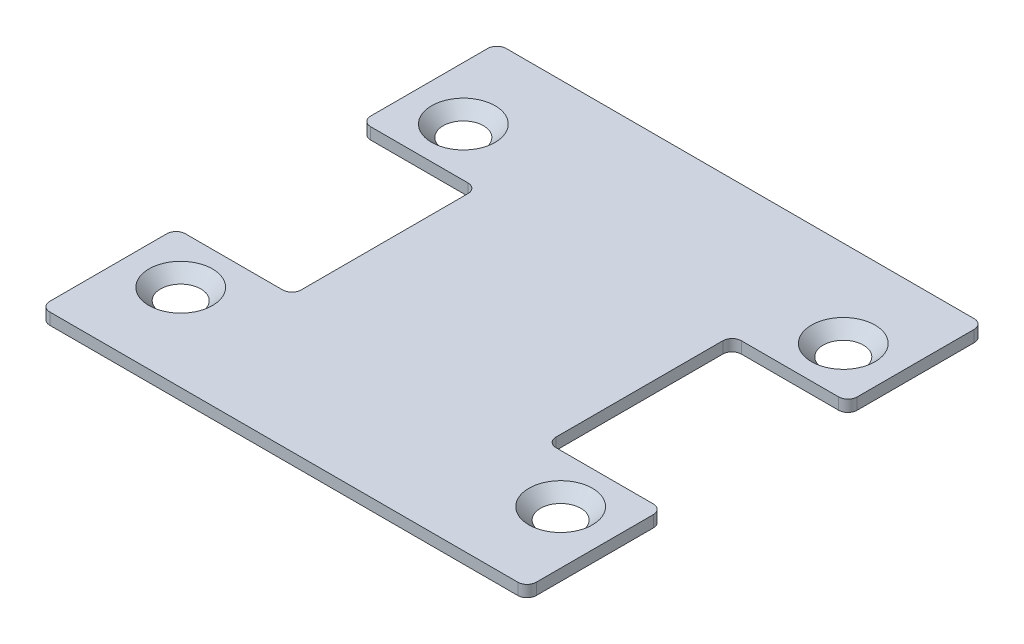
ISO-10303-21;
HEADER;
FILE_DESCRIPTION(('STEP AP214'),'2;1');
FILE_NAME('part.step','',(''),(''),'','','');
FILE_SCHEMA(('AUTOMOTIVE_DESIGN { 1 0 10303 214 1 1 1 1 }'));
ENDSEC;
DATA;
#1=APPLICATION_CONTEXT('core data for automotive mechanical design processes');
#2=APPLICATION_PROTOCOL_DEFINITION('international standard','automotive_design',2000,#1);
#3=PRODUCT_CONTEXT('',#1,'mechanical');
#4=PRODUCT('Part','Part','',(#3));
#5=PRODUCT_RELATED_PRODUCT_CATEGORY('part','',(#4));
#6=PRODUCT_DEFINITION_FORMATION('','',#4);
#7=PRODUCT_DEFINITION_CONTEXT('part definition',#1,'design');
#8=PRODUCT_DEFINITION('design','',#6,#7);
#9=PRODUCT_DEFINITION_SHAPE('','',#8);
#10=(LENGTH_UNIT() NAMED_UNIT(*) SI_UNIT(.MILLI.,.METRE.));
#11=(NAMED_UNIT(*) PLANE_ANGLE_UNIT() SI_UNIT($,.RADIAN.));
#12=(NAMED_UNIT(*) SI_UNIT($,.STERADIAN.) SOLID_ANGLE_UNIT());
#13=UNCERTAINTY_MEASURE_WITH_UNIT(LENGTH_MEASURE(1.E-05),#10,'distance_accuracy_value','');
#14=(GEOMETRIC_REPRESENTATION_CONTEXT(3) GLOBAL_UNCERTAINTY_ASSIGNED_CONTEXT((#13)) GLOBAL_UNIT_ASSIGNED_CONTEXT((#10,
#11,#12)) REPRESENTATION_CONTEXT('',''));
#15=CARTESIAN_POINT('',(0.,0.,0.));
#16=DIRECTION('',(0.,0.,1.));
#17=DIRECTION('',(1.,0.,0.));
#18=AXIS2_PLACEMENT_3D('',#15,#16,#17);
#19=CARTESIAN_POINT('',(50.5,2.5,47.25));
#20=DIRECTION('',(0.,-1.,0.));
#21=DIRECTION('',(0.,0.,-1.));
#22=AXIS2_PLACEMENT_3D('',#19,#20,#21);
#23=PLANE('',#22);
#24=DIRECTION('',(0.,0.,1.));
#25=VECTOR('',#24,1.);
#26=CARTESIAN_POINT('',(52.5,2.5,22.));
#27=LINE('',#26,#25);
#28=CARTESIAN_POINT('',(52.5,2.5,47.25));
#29=VERTEX_POINT('',#28);
#30=CARTESIAN_POINT('',(52.5,2.5,22.));
#31=VERTEX_POINT('',#30);
#32=EDGE_CURVE('E181',#29,#31,#27,.F.);
#33=ORIENTED_EDGE('',*,*,#32,.T.);
#34=CARTESIAN_POINT('',(50.5,2.5,22.));
#35=DIRECTION('',(0.,-1.,0.));
#36=DIRECTION('',(0.,0.,-1.));
#37=AXIS2_PLACEMENT_3D('',#34,#35,#36);
#38=CIRCLE('',#37,1.99999999999998);
#39=CARTESIAN_POINT('',(50.5,2.5,20.));
#40=VERTEX_POINT('',#39);
#41=EDGE_CURVE('E194',#40,#31,#38,.T.);
#42=ORIENTED_EDGE('',*,*,#41,.F.);
#43=DIRECTION('',(1.,0.,0.));
#44=VECTOR('',#43,1.);
#45=CARTESIAN_POINT('',(29.5,2.5,20.));
#46=LINE('',#45,#44);
#47=CARTESIAN_POINT('',(29.5,2.5,20.));
#48=VERTEX_POINT('',#47);
#49=EDGE_CURVE('E204',#40,#48,#46,.F.);
#50=ORIENTED_EDGE('',*,*,#49,.T.);
#51=CARTESIAN_POINT('',(29.5,2.5,18.));
#52=DIRECTION('',(0.,-1.,0.));
#53=DIRECTION('',(0.,0.,-1.));
#54=AXIS2_PLACEMENT_3D('',#51,#52,#53);
#55=CIRCLE('',#54,2.);
#56=CARTESIAN_POINT('',(27.5,2.5,18.));
#57=VERTEX_POINT('',#56);
#58=EDGE_CURVE('E302',#48,#57,#55,.T.);
#59=ORIENTED_EDGE('',*,*,#58,.T.);
#60=DIRECTION('',(0.,0.,1.));
#61=VECTOR('',#60,1.);
#62=CARTESIAN_POINT('',(27.5,2.5,-18.));
#63=LINE('',#62,#61);
#64=CARTESIAN_POINT('',(27.5,2.5,-18.));
#65=VERTEX_POINT('',#64);
#66=EDGE_CURVE('E208',#57,#65,#63,.F.);
#67=ORIENTED_EDGE('',*,*,#66,.T.);
#68=CARTESIAN_POINT('',(29.5,2.5,-18.));
#69=DIRECTION('',(0.,-1.,0.));
#70=DIRECTION('',(0.,0.,-1.));
#71=AXIS2_PLACEMENT_3D('',#68,#69,#70);
#72=CIRCLE('',#71,2.);
#73=CARTESIAN_POINT('',(29.5,2.5,-20.));
#74=VERTEX_POINT('',#73);
#75=EDGE_CURVE('E304',#65,#74,#72,.T.);
#76=ORIENTED_EDGE('',*,*,#75,.T.);
#77=DIRECTION('',(-1.,0.,0.));
#78=VECTOR('',#77,1.);
#79=CARTESIAN_POINT('',(29.5,2.5,-20.));
#80=LINE('',#79,#78);
#81=CARTESIAN_POINT('',(50.5,2.5,-20.));
#82=VERTEX_POINT('',#81);
#83=EDGE_CURVE('E212',#74,#82,#80,.F.);
#84=ORIENTED_EDGE('',*,*,#83,.T.);
#85=CARTESIAN_POINT('',(50.5,2.5,-22.));
#86=DIRECTION('',(0.,-1.,0.));
#87=DIRECTION('',(0.,0.,-1.));
#88=AXIS2_PLACEMENT_3D('',#85,#86,#87);
#89=CIRCLE('',#88,2.00000000000001);
#90=CARTESIAN_POINT('',(52.5,2.5,-22.));
#91=VERTEX_POINT('',#90);
#92=EDGE_CURVE('E215',#91,#82,#89,.T.);
#93=ORIENTED_EDGE('',*,*,#92,.F.);
#94=DIRECTION('',(0.,0.,1.));
#95=VECTOR('',#94,1.);
#96=CARTESIAN_POINT('',(52.5,2.5,-47.25));
#97=LINE('',#96,#95);
#98=CARTESIAN_POINT('',(52.5,2.5,-47.25));
#99=VERTEX_POINT('',#98);
#100=EDGE_CURVE('E216',#91,#99,#97,.F.);
#101=ORIENTED_EDGE('',*,*,#100,.T.);
#102=CARTESIAN_POINT('',(50.5,2.5,-47.25));
#103=DIRECTION('',(0.,-1.,0.));
#104=DIRECTION('',(0.,0.,-1.));
#105=AXIS2_PLACEMENT_3D('',#102,#103,#104);
#106=CIRCLE('',#105,2.);
#107=CARTESIAN_POINT('',(50.5,2.5,-49.25));
#108=VERTEX_POINT('',#107);
#109=EDGE_CURVE('E219',#108,#99,#106,.T.);
#110=ORIENTED_EDGE('',*,*,#109,.F.);
#111=DIRECTION('',(1.,0.,0.));
#112=VECTOR('',#111,1.);
#113=CARTESIAN_POINT('',(50.5,2.5,-49.25));
#114=LINE('',#113,#112);
#115=CARTESIAN_POINT('',(-50.5,2.5,-49.25));
#116=VERTEX_POINT('',#115);
#117=EDGE_CURVE('E220',#108,#116,#114,.F.);
#118=ORIENTED_EDGE('',*,*,#117,.T.);
#119=CARTESIAN_POINT('',(-50.5,2.5,-47.25));
#120=DIRECTION('',(0.,-1.,0.));
#121=DIRECTION('',(0.,0.,-1.));
#122=AXIS2_PLACEMENT_3D('',#119,#120,#121);
#123=CIRCLE('',#122,2.);
#124=CARTESIAN_POINT('',(-52.5,2.5,-47.25));
#125=VERTEX_POINT('',#124);
#126=EDGE_CURVE('E223',#125,#116,#123,.T.);
#127=ORIENTED_EDGE('',*,*,#126,.F.);
#128=DIRECTION('',(0.,0.,-1.));
#129=VECTOR('',#128,1.);
#130=CARTESIAN_POINT('',(-52.5,2.5,-47.25));
#131=LINE('',#130,#129);
#132=CARTESIAN_POINT('',(-52.5,2.5,-22.));
#133=VERTEX_POINT('',#132);
#134=EDGE_CURVE('E224',#125,#133,#131,.F.);
#135=ORIENTED_EDGE('',*,*,#134,.T.);
#136=CARTESIAN_POINT('',(-50.5,2.5,-22.));
#137=DIRECTION('',(0.,-1.,0.));
#138=DIRECTION('',(0.,0.,-1.));
#139=AXIS2_PLACEMENT_3D('',#136,#137,#138);
#140=CIRCLE('',#139,2.00000000000001);
#141=CARTESIAN_POINT('',(-50.5,2.5,-20.));
#142=VERTEX_POINT('',#141);
#143=EDGE_CURVE('E227',#142,#133,#140,.T.);
#144=ORIENTED_EDGE('',*,*,#143,.F.);
#145=DIRECTION('',(-1.,0.,0.));
#146=VECTOR('',#145,1.);
#147=CARTESIAN_POINT('',(-29.5,2.5,-20.));
#148=LINE('',#147,#146);
#149=CARTESIAN_POINT('',(-29.5,2.5,-20.));
#150=VERTEX_POINT('',#149);
#151=EDGE_CURVE('E228',#142,#150,#148,.F.);
#152=ORIENTED_EDGE('',*,*,#151,.T.);
#153=CARTESIAN_POINT('',(-29.5,2.5,-18.));
#154=DIRECTION('',(0.,-1.,0.));
#155=DIRECTION('',(0.,0.,-1.));
#156=AXIS2_PLACEMENT_3D('',#153,#154,#155);
#157=CIRCLE('',#156,2.);
#158=CARTESIAN_POINT('',(-27.5,2.5,-18.));
#159=VERTEX_POINT('',#158);
#160=EDGE_CURVE('E318',#150,#159,#157,.T.);
#161=ORIENTED_EDGE('',*,*,#160,.T.);
#162=DIRECTION('',(0.,0.,-1.));
#163=VECTOR('',#162,1.);
#164=CARTESIAN_POINT('',(-27.5,2.5,-18.));
#165=LINE('',#164,#163);
#166=CARTESIAN_POINT('',(-27.5,2.5,18.));
#167=VERTEX_POINT('',#166);
#168=EDGE_CURVE('E232',#159,#167,#165,.F.);
#169=ORIENTED_EDGE('',*,*,#168,.T.);
#170=CARTESIAN_POINT('',(-29.5,2.5,18.));
#171=DIRECTION('',(0.,-1.,0.));
#172=DIRECTION('',(0.,0.,-1.));
#173=AXIS2_PLACEMENT_3D('',#170,#171,#172);
#174=CIRCLE('',#173,2.);
#175=CARTESIAN_POINT('',(-29.5,2.5,20.));
#176=VERTEX_POINT('',#175);
#177=EDGE_CURVE('E320',#167,#176,#174,.T.);
#178=ORIENTED_EDGE('',*,*,#177,.T.);
#179=DIRECTION('',(1.,0.,0.));
#180=VECTOR('',#179,1.);
#181=CARTESIAN_POINT('',(-29.5,2.5,20.));
#182=LINE('',#181,#180);
#183=CARTESIAN_POINT('',(-50.5,2.5,20.));
#184=VERTEX_POINT('',#183);
#185=EDGE_CURVE('E236',#176,#184,#182,.F.);
#186=ORIENTED_EDGE('',*,*,#185,.T.);
#187=CARTESIAN_POINT('',(-50.5,2.5,22.));
#188=DIRECTION('',(0.,-1.,0.));
#189=DIRECTION('',(0.,0.,-1.));
#190=AXIS2_PLACEMENT_3D('',#187,#188,#189);
#191=CIRCLE('',#190,1.99999999999998);
#192=CARTESIAN_POINT('',(-52.5,2.5,22.));
#193=VERTEX_POINT('',#192);
#194=EDGE_CURVE('E239',#193,#184,#191,.T.);
#195=ORIENTED_EDGE('',*,*,#194,.F.);
#196=DIRECTION('',(0.,0.,-1.));
#197=VECTOR('',#196,1.);
#198=CARTESIAN_POINT('',(-52.5,2.5,22.));
#199=LINE('',#198,#197);
#200=CARTESIAN_POINT('',(-52.5,2.5,47.25));
#201=VERTEX_POINT('',#200);
#202=EDGE_CURVE('E240',#193,#201,#199,.F.);
#203=ORIENTED_EDGE('',*,*,#202,.T.);
#204=CARTESIAN_POINT('',(-50.5,2.5,47.25));
#205=DIRECTION('',(0.,-1.,0.));
#206=DIRECTION('',(0.,0.,-1.));
#207=AXIS2_PLACEMENT_3D('',#204,#205,#206);
#208=CIRCLE('',#207,1.99999999999999);
#209=CARTESIAN_POINT('',(-50.5,2.5,49.25));
#210=VERTEX_POINT('',#209);
#211=EDGE_CURVE('E243',#210,#201,#208,.T.);
#212=ORIENTED_EDGE('',*,*,#211,.F.);
#213=DIRECTION('',(-1.,0.,0.));
#214=VECTOR('',#213,1.);
#215=CARTESIAN_POINT('',(50.5,2.5,49.25));
#216=LINE('',#215,#214);
#217=CARTESIAN_POINT('',(50.5,2.5,49.25));
#218=VERTEX_POINT('',#217);
#219=EDGE_CURVE('E183',#210,#218,#216,.F.);
#220=ORIENTED_EDGE('',*,*,#219,.T.);
#221=CARTESIAN_POINT('',(50.5,2.5,47.25));
#222=DIRECTION('',(0.,-1.,0.));
#223=DIRECTION('',(0.,0.,-1.));
#224=AXIS2_PLACEMENT_3D('',#221,#222,#223);
#225=CIRCLE('',#224,1.99999999999999);
#226=EDGE_CURVE('E176',#29,#218,#225,.T.);
#227=ORIENTED_EDGE('',*,*,#226,.F.);
#228=EDGE_LOOP('',(#33,#42,#50,#59,#67,#76,#84,#93,#101,#110,#118,#127,#135,#144,#152,#161,#169,
#178,#186,#195,#203,#212,#220,#227));
#229=FACE_BOUND('',#228,.T.);
#230=CARTESIAN_POINT('',(41.,2.49999999999773,30.5));
#231=DIRECTION('',(0.,1.,0.));
#232=DIRECTION('',(0.,0.,1.));
#233=AXIS2_PLACEMENT_3D('',#230,#231,#232);
#234=CIRCLE('',#233,6.85499999999093);
#235=CARTESIAN_POINT('',(41.,2.49999999999773,37.3549999999909));
#236=VERTEX_POINT('',#235);
#237=EDGE_CURVE('E186',#236,#236,#234,.F.);
#238=ORIENTED_EDGE('',*,*,#237,.T.);
#239=EDGE_LOOP('',(#238));
#240=FACE_BOUND('',#239,.T.);
#241=CARTESIAN_POINT('',(41.,2.49999999999773,-30.5));
#242=DIRECTION('',(0.,1.,0.));
#243=DIRECTION('',(0.,0.,1.));
#244=AXIS2_PLACEMENT_3D('',#241,#242,#243);
#245=CIRCLE('',#244,6.8550000000123);
#246=CARTESIAN_POINT('',(41.,2.49999999999773,-23.6449999999877));
#247=VERTEX_POINT('',#246);
#248=EDGE_CURVE('E330',#247,#247,#245,.F.);
#249=ORIENTED_EDGE('',*,*,#248,.T.);
#250=EDGE_LOOP('',(#249));
#251=FACE_BOUND('',#250,.T.);
#252=CARTESIAN_POINT('',(-41.,2.49999999999773,-30.5));
#253=DIRECTION('',(0.,1.,0.));
#254=DIRECTION('',(0.,0.,1.));
#255=AXIS2_PLACEMENT_3D('',#252,#253,#254);
#256=CIRCLE('',#255,6.85500000001229);
#257=CARTESIAN_POINT('',(-41.,2.49999999999773,-23.6449999999877));
#258=VERTEX_POINT('',#257);
#259=EDGE_CURVE('E332',#258,#258,#256,.F.);
#260=ORIENTED_EDGE('',*,*,#259,.T.);
#261=EDGE_LOOP('',(#260));
#262=FACE_BOUND('',#261,.T.);
#263=CARTESIAN_POINT('',(-41.,2.49999999994088,30.5));
#264=DIRECTION('',(0.,1.,0.));
#265=DIRECTION('',(0.,0.,1.));
#266=AXIS2_PLACEMENT_3D('',#263,#264,#265);
#267=CIRCLE('',#266,6.85499999999092);
#268=CARTESIAN_POINT('',(-41.,2.49999999994088,37.3549999999909));
#269=VERTEX_POINT('',#268);
#270=EDGE_CURVE('E20',#269,#269,#267,.F.);
#271=ORIENTED_EDGE('',*,*,#270,.T.);
#272=EDGE_LOOP('',(#271));
#273=FACE_BOUND('',#272,.T.);
#274=ADVANCED_FACE('F17',(#229,#240,#251,#262,#273),#23,.F.);
#275=CARTESIAN_POINT('',(-41.,2.49999999988404,30.5));
#276=DIRECTION('',(0.,1.,0.));
#277=DIRECTION('',(0.,0.,1.));
#278=AXIS2_PLACEMENT_3D('',#275,#276,#277);
#279=CONICAL_SURFACE('',#278,6.85499999993408,0.785398163397448);
#280=CARTESIAN_POINT('',(-41.,3.91110754893731E-11,30.5));
#281=DIRECTION('',(0.,1.,0.));
#282=DIRECTION('',(0.,0.,1.));
#283=AXIS2_PLACEMENT_3D('',#280,#281,#282);
#284=CIRCLE('',#283,4.35500000008915);
#285=CARTESIAN_POINT('',(-41.,3.91110754893731E-11,34.8550000000891));
#286=VERTEX_POINT('',#285);
#287=EDGE_CURVE('E198',#286,#286,#284,.T.);
#288=ORIENTED_EDGE('',*,*,#287,.F.);
#289=EDGE_LOOP('',(#288));
#290=FACE_BOUND('',#289,.T.);
#291=ORIENTED_EDGE('',*,*,#270,.F.);
#292=EDGE_LOOP('',(#291));
#293=FACE_BOUND('',#292,.T.);
#294=ADVANCED_FACE('F340',(#290,#293),#279,.F.);
#295=CARTESIAN_POINT('',(-41.,2.49999999994088,-30.5));
#296=DIRECTION('',(0.,1.,0.));
#297=DIRECTION('',(0.,0.,1.));
#298=AXIS2_PLACEMENT_3D('',#295,#296,#297);
#299=CONICAL_SURFACE('',#298,6.85499999995544,0.78539816338608);
#300=CARTESIAN_POINT('',(-41.,0.,-30.5));
#301=DIRECTION('',(0.,1.,0.));
#302=DIRECTION('',(0.,0.,1.));
#303=AXIS2_PLACEMENT_3D('',#300,#301,#302);
#304=CIRCLE('',#303,4.3550000000714);
#305=CARTESIAN_POINT('',(-41.,0.,-26.1449999999286));
#306=VERTEX_POINT('',#305);
#307=EDGE_CURVE('E295',#306,#306,#304,.T.);
#308=ORIENTED_EDGE('',*,*,#307,.F.);
#309=EDGE_LOOP('',(#308));
#310=FACE_BOUND('',#309,.T.);
#311=ORIENTED_EDGE('',*,*,#259,.F.);
#312=EDGE_LOOP('',(#311));
#313=FACE_BOUND('',#312,.T.);
#314=ADVANCED_FACE('F342',(#310,#313),#299,.F.);
#315=CARTESIAN_POINT('',(41.,2.49999999994088,-30.5));
#316=DIRECTION('',(0.,1.,0.));
#317=DIRECTION('',(0.,0.,1.));
#318=AXIS2_PLACEMENT_3D('',#315,#316,#317);
#319=CONICAL_SURFACE('',#318,6.85499999995546,0.78539816338608);
#320=CARTESIAN_POINT('',(41.,0.,-30.5));
#321=DIRECTION('',(0.,1.,0.));
#322=DIRECTION('',(0.,0.,1.));
#323=AXIS2_PLACEMENT_3D('',#320,#321,#322);
#324=CIRCLE('',#323,4.35500000007142);
#325=CARTESIAN_POINT('',(41.,0.,-26.1449999999286));
#326=VERTEX_POINT('',#325);
#327=EDGE_CURVE('E292',#326,#326,#324,.T.);
#328=ORIENTED_EDGE('',*,*,#327,.F.);
#329=EDGE_LOOP('',(#328));
#330=FACE_BOUND('',#329,.T.);
#331=ORIENTED_EDGE('',*,*,#248,.F.);
#332=EDGE_LOOP('',(#331));
#333=FACE_BOUND('',#332,.T.);
#334=ADVANCED_FACE('F349',(#330,#333),#319,.F.);
#335=CARTESIAN_POINT('',(41.,2.49999999994088,30.5));
#336=DIRECTION('',(0.,1.,0.));
#337=DIRECTION('',(0.,0.,1.));
#338=AXIS2_PLACEMENT_3D('',#335,#336,#337);
#339=CONICAL_SURFACE('',#338,6.85499999993408,0.785398163397448);
#340=CARTESIAN_POINT('',(41.,3.91041365954692E-11,30.5));
#341=DIRECTION('',(0.,1.,0.));
#342=DIRECTION('',(0.,0.,1.));
#343=AXIS2_PLACEMENT_3D('',#340,#341,#342);
#344=CIRCLE('',#343,4.35500000003231);
#345=CARTESIAN_POINT('',(41.,3.91041365954692E-11,34.8550000000323));
#346=VERTEX_POINT('',#345);
#347=EDGE_CURVE('E289',#346,#346,#344,.T.);
#348=ORIENTED_EDGE('',*,*,#347,.F.);
#349=EDGE_LOOP('',(#348));
#350=FACE_BOUND('',#349,.T.);
#351=ORIENTED_EDGE('',*,*,#237,.F.);
#352=EDGE_LOOP('',(#351));
#353=FACE_BOUND('',#352,.T.);
#354=ADVANCED_FACE('F452',(#350,#353),#339,.F.);
#355=CARTESIAN_POINT('',(50.5,2.5,47.25));
#356=DIRECTION('',(0.,-1.,0.));
#357=DIRECTION('',(0.,0.,-1.));
#358=AXIS2_PLACEMENT_3D('',#355,#356,#357);
#359=CYLINDRICAL_SURFACE('',#358,1.99999999999999);
#360=ORIENTED_EDGE('',*,*,#226,.T.);
#361=DIRECTION('',(0.,1.,0.));
#362=VECTOR('',#361,1.);
#363=CARTESIAN_POINT('',(50.5,2.5,49.25));
#364=LINE('',#363,#362);
#365=CARTESIAN_POINT('',(50.5,0.,49.25));
#366=VERTEX_POINT('',#365);
#367=EDGE_CURVE('E202',#218,#366,#364,.F.);
#368=ORIENTED_EDGE('',*,*,#367,.T.);
#369=CARTESIAN_POINT('',(50.5,0.,47.25));
#370=DIRECTION('',(0.,-1.,0.));
#371=DIRECTION('',(0.,0.,-1.));
#372=AXIS2_PLACEMENT_3D('',#369,#370,#371);
#373=CIRCLE('',#372,1.99999999999999);
#374=CARTESIAN_POINT('',(52.5,0.,47.25));
#375=VERTEX_POINT('',#374);
#376=EDGE_CURVE('E192',#375,#366,#373,.T.);
#377=ORIENTED_EDGE('',*,*,#376,.F.);
#378=DIRECTION('',(0.,1.,0.));
#379=VECTOR('',#378,1.);
#380=CARTESIAN_POINT('',(52.5,2.5,47.25));
#381=LINE('',#380,#379);
#382=EDGE_CURVE('E189',#375,#29,#381,.T.);
#383=ORIENTED_EDGE('',*,*,#382,.T.);
#384=EDGE_LOOP('',(#360,#368,#377,#383));
#385=FACE_BOUND('',#384,.T.);
#386=ADVANCED_FACE('F190',(#385),#359,.T.);
#387=CARTESIAN_POINT('',(50.5,2.5,49.25));
#388=DIRECTION('',(0.,0.,-1.));
#389=DIRECTION('',(-1.,0.,0.));
#390=AXIS2_PLACEMENT_3D('',#387,#388,#389);
#391=PLANE('',#390);
#392=ORIENTED_EDGE('',*,*,#367,.F.);
#393=ORIENTED_EDGE('',*,*,#219,.F.);
#394=DIRECTION('',(0.,-1.,0.));
#395=VECTOR('',#394,1.);
#396=CARTESIAN_POINT('',(-50.5,2.5,49.25));
#397=LINE('',#396,#395);
#398=CARTESIAN_POINT('',(-50.5,0.,49.25));
#399=VERTEX_POINT('',#398);
#400=EDGE_CURVE('E326',#399,#210,#397,.F.);
#401=ORIENTED_EDGE('',*,*,#400,.F.);
#402=DIRECTION('',(1.,0.,0.));
#403=VECTOR('',#402,1.);
#404=CARTESIAN_POINT('',(50.5,0.,49.25));
#405=LINE('',#404,#403);
#406=EDGE_CURVE('E287',#366,#399,#405,.F.);
#407=ORIENTED_EDGE('',*,*,#406,.F.);
#408=EDGE_LOOP('',(#392,#393,#401,#407));
#409=FACE_BOUND('',#408,.T.);
#410=ADVANCED_FACE('F445',(#409),#391,.F.);
#411=CARTESIAN_POINT('',(-50.5,2.5,47.25));
#412=DIRECTION('',(0.,-1.,0.));
#413=DIRECTION('',(0.,0.,-1.));
#414=AXIS2_PLACEMENT_3D('',#411,#412,#413);
#415=CYLINDRICAL_SURFACE('',#414,1.99999999999999);
#416=ORIENTED_EDGE('',*,*,#211,.T.);
#417=DIRECTION('',(0.,1.,0.));
#418=VECTOR('',#417,1.);
#419=CARTESIAN_POINT('',(-52.5,2.5,47.25));
#420=LINE('',#419,#418);
#421=CARTESIAN_POINT('',(-52.5,0.,47.25));
#422=VERTEX_POINT('',#421);
#423=EDGE_CURVE('E242',#201,#422,#420,.F.);
#424=ORIENTED_EDGE('',*,*,#423,.T.);
#425=CARTESIAN_POINT('',(-50.5,0.,47.25));
#426=DIRECTION('',(0.,-1.,0.));
#427=DIRECTION('',(0.,0.,-1.));
#428=AXIS2_PLACEMENT_3D('',#425,#426,#427);
#429=CIRCLE('',#428,1.99999999999999);
#430=EDGE_CURVE('E284',#399,#422,#429,.T.);
#431=ORIENTED_EDGE('',*,*,#430,.F.);
#432=ORIENTED_EDGE('',*,*,#400,.T.);
#433=EDGE_LOOP('',(#416,#424,#431,#432));
#434=FACE_BOUND('',#433,.T.);
#435=ADVANCED_FACE('F441',(#434),#415,.T.);
#436=CARTESIAN_POINT('',(-52.5,2.5,22.));
#437=DIRECTION('',(1.,0.,0.));
#438=DIRECTION('',(0.,0.,-1.));
#439=AXIS2_PLACEMENT_3D('',#436,#437,#438);
#440=PLANE('',#439);
#441=ORIENTED_EDGE('',*,*,#423,.F.);
#442=ORIENTED_EDGE('',*,*,#202,.F.);
#443=DIRECTION('',(0.,-1.,0.));
#444=VECTOR('',#443,1.);
#445=CARTESIAN_POINT('',(-52.5,2.5,22.));
#446=LINE('',#445,#444);
#447=CARTESIAN_POINT('',(-52.5,0.,22.));
#448=VERTEX_POINT('',#447);
#449=EDGE_CURVE('E324',#448,#193,#446,.F.);
#450=ORIENTED_EDGE('',*,*,#449,.F.);
#451=DIRECTION('',(0.,0.,-1.));
#452=VECTOR('',#451,1.);
#453=CARTESIAN_POINT('',(-52.5,0.,47.25));
#454=LINE('',#453,#452);
#455=EDGE_CURVE('E283',#422,#448,#454,.T.);
#456=ORIENTED_EDGE('',*,*,#455,.F.);
#457=EDGE_LOOP('',(#441,#442,#450,#456));
#458=FACE_BOUND('',#457,.T.);
#459=ADVANCED_FACE('F437',(#458),#440,.F.);
#460=CARTESIAN_POINT('',(-50.5,2.5,22.));
#461=DIRECTION('',(0.,-1.,0.));
#462=DIRECTION('',(0.,0.,-1.));
#463=AXIS2_PLACEMENT_3D('',#460,#461,#462);
#464=CYLINDRICAL_SURFACE('',#463,1.99999999999998);
#465=ORIENTED_EDGE('',*,*,#194,.T.);
#466=DIRECTION('',(0.,1.,0.));
#467=VECTOR('',#466,1.);
#468=CARTESIAN_POINT('',(-50.5,2.5,20.));
#469=LINE('',#468,#467);
#470=CARTESIAN_POINT('',(-50.5,0.,20.));
#471=VERTEX_POINT('',#470);
#472=EDGE_CURVE('E238',#184,#471,#469,.F.);
#473=ORIENTED_EDGE('',*,*,#472,.T.);
#474=CARTESIAN_POINT('',(-50.5,0.,22.));
#475=DIRECTION('',(0.,-1.,0.));
#476=DIRECTION('',(0.,0.,-1.));
#477=AXIS2_PLACEMENT_3D('',#474,#475,#476);
#478=CIRCLE('',#477,1.99999999999998);
#479=EDGE_CURVE('E280',#448,#471,#478,.T.);
#480=ORIENTED_EDGE('',*,*,#479,.F.);
#481=ORIENTED_EDGE('',*,*,#449,.T.);
#482=EDGE_LOOP('',(#465,#473,#480,#481));
#483=FACE_BOUND('',#482,.T.);
#484=ADVANCED_FACE('F433',(#483),#464,.T.);
#485=CARTESIAN_POINT('',(-29.5,2.5,20.));
#486=DIRECTION('',(0.,0.,1.));
#487=DIRECTION('',(1.,0.,0.));
#488=AXIS2_PLACEMENT_3D('',#485,#486,#487);
#489=PLANE('',#488);
#490=ORIENTED_EDGE('',*,*,#472,.F.);
#491=ORIENTED_EDGE('',*,*,#185,.F.);
#492=DIRECTION('',(0.,-1.,0.));
#493=VECTOR('',#492,1.);
#494=CARTESIAN_POINT('',(-29.5,2.5,20.));
#495=LINE('',#494,#493);
#496=CARTESIAN_POINT('',(-29.5,0.,20.));
#497=VERTEX_POINT('',#496);
#498=EDGE_CURVE('E235',#176,#497,#495,.T.);
#499=ORIENTED_EDGE('',*,*,#498,.T.);
#500=DIRECTION('',(1.,0.,0.));
#501=VECTOR('',#500,1.);
#502=CARTESIAN_POINT('',(50.5,0.,20.));
#503=LINE('',#502,#501);
#504=EDGE_CURVE('E279',#471,#497,#503,.T.);
#505=ORIENTED_EDGE('',*,*,#504,.F.);
#506=EDGE_LOOP('',(#490,#491,#499,#505));
#507=FACE_BOUND('',#506,.T.);
#508=ADVANCED_FACE('F429',(#507),#489,.F.);
#509=CARTESIAN_POINT('',(-29.5,2.5,18.));
#510=DIRECTION('',(0.,-1.,0.));
#511=DIRECTION('',(0.,0.,-1.));
#512=AXIS2_PLACEMENT_3D('',#509,#510,#511);
#513=CYLINDRICAL_SURFACE('',#512,2.);
#514=ORIENTED_EDGE('',*,*,#498,.F.);
#515=ORIENTED_EDGE('',*,*,#177,.F.);
#516=DIRECTION('',(0.,1.,0.));
#517=VECTOR('',#516,1.);
#518=CARTESIAN_POINT('',(-27.5,2.5,18.));
#519=LINE('',#518,#517);
#520=CARTESIAN_POINT('',(-27.5,0.,18.));
#521=VERTEX_POINT('',#520);
#522=EDGE_CURVE('E234',#167,#521,#519,.F.);
#523=ORIENTED_EDGE('',*,*,#522,.T.);
#524=CARTESIAN_POINT('',(-29.5,0.,18.));
#525=DIRECTION('',(0.,-1.,0.));
#526=DIRECTION('',(0.,0.,-1.));
#527=AXIS2_PLACEMENT_3D('',#524,#525,#526);
#528=CIRCLE('',#527,2.);
#529=EDGE_CURVE('E276',#497,#521,#528,.F.);
#530=ORIENTED_EDGE('',*,*,#529,.F.);
#531=EDGE_LOOP('',(#514,#515,#523,#530));
#532=FACE_BOUND('',#531,.T.);
#533=ADVANCED_FACE('F425',(#532),#513,.F.);
#534=CARTESIAN_POINT('',(-27.5,2.5,-18.));
#535=DIRECTION('',(1.,0.,0.));
#536=DIRECTION('',(0.,0.,-1.));
#537=AXIS2_PLACEMENT_3D('',#534,#535,#536);
#538=PLANE('',#537);
#539=ORIENTED_EDGE('',*,*,#522,.F.);
#540=ORIENTED_EDGE('',*,*,#168,.F.);
#541=DIRECTION('',(0.,-1.,0.));
#542=VECTOR('',#541,1.);
#543=CARTESIAN_POINT('',(-27.5,2.5,-18.));
#544=LINE('',#543,#542);
#545=CARTESIAN_POINT('',(-27.5,0.,-18.));
#546=VERTEX_POINT('',#545);
#547=EDGE_CURVE('E231',#159,#546,#544,.T.);
#548=ORIENTED_EDGE('',*,*,#547,.T.);
#549=DIRECTION('',(0.,0.,-1.));
#550=VECTOR('',#549,1.);
#551=CARTESIAN_POINT('',(-27.5,0.,47.25));
#552=LINE('',#551,#550);
#553=EDGE_CURVE('E275',#521,#546,#552,.T.);
#554=ORIENTED_EDGE('',*,*,#553,.F.);
#555=EDGE_LOOP('',(#539,#540,#548,#554));
#556=FACE_BOUND('',#555,.T.);
#557=ADVANCED_FACE('F421',(#556),#538,.F.);
#558=CARTESIAN_POINT('',(-29.5,2.5,-18.));
#559=DIRECTION('',(0.,-1.,0.));
#560=DIRECTION('',(0.,0.,-1.));
#561=AXIS2_PLACEMENT_3D('',#558,#559,#560);
#562=CYLINDRICAL_SURFACE('',#561,2.);
#563=ORIENTED_EDGE('',*,*,#547,.F.);
#564=ORIENTED_EDGE('',*,*,#160,.F.);
#565=DIRECTION('',(0.,1.,0.));
#566=VECTOR('',#565,1.);
#567=CARTESIAN_POINT('',(-29.5,2.5,-20.));
#568=LINE('',#567,#566);
#569=CARTESIAN_POINT('',(-29.5,0.,-20.));
#570=VERTEX_POINT('',#569);
#571=EDGE_CURVE('E230',#150,#570,#568,.F.);
#572=ORIENTED_EDGE('',*,*,#571,.T.);
#573=CARTESIAN_POINT('',(-29.5,0.,-18.));
#574=DIRECTION('',(0.,-1.,0.));
#575=DIRECTION('',(0.,0.,-1.));
#576=AXIS2_PLACEMENT_3D('',#573,#574,#575);
#577=CIRCLE('',#576,2.);
#578=EDGE_CURVE('E272',#546,#570,#577,.F.);
#579=ORIENTED_EDGE('',*,*,#578,.F.);
#580=EDGE_LOOP('',(#563,#564,#572,#579));
#581=FACE_BOUND('',#580,.T.);
#582=ADVANCED_FACE('F417',(#581),#562,.F.);
#583=CARTESIAN_POINT('',(-29.5,2.5,-20.));
#584=DIRECTION('',(0.,0.,-1.));
#585=DIRECTION('',(-1.,0.,0.));
#586=AXIS2_PLACEMENT_3D('',#583,#584,#585);
#587=PLANE('',#586);
#588=ORIENTED_EDGE('',*,*,#571,.F.);
#589=ORIENTED_EDGE('',*,*,#151,.F.);
#590=DIRECTION('',(0.,-1.,0.));
#591=VECTOR('',#590,1.);
#592=CARTESIAN_POINT('',(-50.5,2.5,-20.));
#593=LINE('',#592,#591);
#594=CARTESIAN_POINT('',(-50.5,0.,-20.));
#595=VERTEX_POINT('',#594);
#596=EDGE_CURVE('E317',#595,#142,#593,.F.);
#597=ORIENTED_EDGE('',*,*,#596,.F.);
#598=DIRECTION('',(1.,0.,0.));
#599=VECTOR('',#598,1.);
#600=CARTESIAN_POINT('',(50.5,0.,-20.));
#601=LINE('',#600,#599);
#602=EDGE_CURVE('E271',#570,#595,#601,.F.);
#603=ORIENTED_EDGE('',*,*,#602,.F.);
#604=EDGE_LOOP('',(#588,#589,#597,#603));
#605=FACE_BOUND('',#604,.T.);
#606=ADVANCED_FACE('F413',(#605),#587,.F.);
#607=CARTESIAN_POINT('',(-50.5,2.5,-22.));
#608=DIRECTION('',(0.,-1.,0.));
#609=DIRECTION('',(0.,0.,-1.));
#610=AXIS2_PLACEMENT_3D('',#607,#608,#609);
#611=CYLINDRICAL_SURFACE('',#610,2.00000000000001);
#612=ORIENTED_EDGE('',*,*,#143,.T.);
#613=DIRECTION('',(0.,1.,0.));
#614=VECTOR('',#613,1.);
#615=CARTESIAN_POINT('',(-52.5,2.5,-22.));
#616=LINE('',#615,#614);
#617=CARTESIAN_POINT('',(-52.5,0.,-22.));
#618=VERTEX_POINT('',#617);
#619=EDGE_CURVE('E226',#133,#618,#616,.F.);
#620=ORIENTED_EDGE('',*,*,#619,.T.);
#621=CARTESIAN_POINT('',(-50.5,0.,-22.));
#622=DIRECTION('',(0.,-1.,0.));
#623=DIRECTION('',(0.,0.,-1.));
#624=AXIS2_PLACEMENT_3D('',#621,#622,#623);
#625=CIRCLE('',#624,2.00000000000001);
#626=EDGE_CURVE('E268',#595,#618,#625,.T.);
#627=ORIENTED_EDGE('',*,*,#626,.F.);
#628=ORIENTED_EDGE('',*,*,#596,.T.);
#629=EDGE_LOOP('',(#612,#620,#627,#628));
#630=FACE_BOUND('',#629,.T.);
#631=ADVANCED_FACE('F409',(#630),#611,.T.);
#632=CARTESIAN_POINT('',(-52.5,2.5,-47.25));
#633=DIRECTION('',(1.,0.,0.));
#634=DIRECTION('',(0.,0.,-1.));
#635=AXIS2_PLACEMENT_3D('',#632,#633,#634);
#636=PLANE('',#635);
#637=ORIENTED_EDGE('',*,*,#619,.F.);
#638=ORIENTED_EDGE('',*,*,#134,.F.);
#639=DIRECTION('',(0.,-1.,0.));
#640=VECTOR('',#639,1.);
#641=CARTESIAN_POINT('',(-52.5,2.5,-47.25));
#642=LINE('',#641,#640);
#643=CARTESIAN_POINT('',(-52.5,0.,-47.25));
#644=VERTEX_POINT('',#643);
#645=EDGE_CURVE('E314',#644,#125,#642,.F.);
#646=ORIENTED_EDGE('',*,*,#645,.F.);
#647=DIRECTION('',(0.,0.,-1.));
#648=VECTOR('',#647,1.);
#649=CARTESIAN_POINT('',(-52.5,0.,47.25));
#650=LINE('',#649,#648);
#651=EDGE_CURVE('E267',#618,#644,#650,.T.);
#652=ORIENTED_EDGE('',*,*,#651,.F.);
#653=EDGE_LOOP('',(#637,#638,#646,#652));
#654=FACE_BOUND('',#653,.T.);
#655=ADVANCED_FACE('F405',(#654),#636,.F.);
#656=CARTESIAN_POINT('',(-50.5,2.5,-47.25));
#657=DIRECTION('',(0.,-1.,0.));
#658=DIRECTION('',(0.,0.,-1.));
#659=AXIS2_PLACEMENT_3D('',#656,#657,#658);
#660=CYLINDRICAL_SURFACE('',#659,2.);
#661=ORIENTED_EDGE('',*,*,#126,.T.);
#662=DIRECTION('',(0.,1.,0.));
#663=VECTOR('',#662,1.);
#664=CARTESIAN_POINT('',(-50.5,2.5,-49.25));
#665=LINE('',#664,#663);
#666=CARTESIAN_POINT('',(-50.5,0.,-49.25));
#667=VERTEX_POINT('',#666);
#668=EDGE_CURVE('E222',#116,#667,#665,.F.);
#669=ORIENTED_EDGE('',*,*,#668,.T.);
#670=CARTESIAN_POINT('',(-50.5,0.,-47.25));
#671=DIRECTION('',(0.,-1.,0.));
#672=DIRECTION('',(0.,0.,-1.));
#673=AXIS2_PLACEMENT_3D('',#670,#671,#672);
#674=CIRCLE('',#673,2.);
#675=EDGE_CURVE('E264',#644,#667,#674,.T.);
#676=ORIENTED_EDGE('',*,*,#675,.F.);
#677=ORIENTED_EDGE('',*,*,#645,.T.);
#678=EDGE_LOOP('',(#661,#669,#676,#677));
#679=FACE_BOUND('',#678,.T.);
#680=ADVANCED_FACE('F401',(#679),#660,.T.);
#681=CARTESIAN_POINT('',(50.5,2.5,-49.25));
#682=DIRECTION('',(0.,0.,1.));
#683=DIRECTION('',(1.,0.,0.));
#684=AXIS2_PLACEMENT_3D('',#681,#682,#683);
#685=PLANE('',#684);
#686=ORIENTED_EDGE('',*,*,#668,.F.);
#687=ORIENTED_EDGE('',*,*,#117,.F.);
#688=DIRECTION('',(0.,-1.,0.));
#689=VECTOR('',#688,1.);
#690=CARTESIAN_POINT('',(50.5,2.5,-49.25));
#691=LINE('',#690,#689);
#692=CARTESIAN_POINT('',(50.5,0.,-49.25));
#693=VERTEX_POINT('',#692);
#694=EDGE_CURVE('E311',#693,#108,#691,.F.);
#695=ORIENTED_EDGE('',*,*,#694,.F.);
#696=DIRECTION('',(1.,0.,0.));
#697=VECTOR('',#696,1.);
#698=CARTESIAN_POINT('',(50.5,0.,-49.25));
#699=LINE('',#698,#697);
#700=EDGE_CURVE('E263',#667,#693,#699,.T.);
#701=ORIENTED_EDGE('',*,*,#700,.F.);
#702=EDGE_LOOP('',(#686,#687,#695,#701));
#703=FACE_BOUND('',#702,.T.);
#704=ADVANCED_FACE('F397',(#703),#685,.F.);
#705=CARTESIAN_POINT('',(50.5,2.5,-47.25));
#706=DIRECTION('',(0.,-1.,0.));
#707=DIRECTION('',(0.,0.,-1.));
#708=AXIS2_PLACEMENT_3D('',#705,#706,#707);
#709=CYLINDRICAL_SURFACE('',#708,2.);
#710=ORIENTED_EDGE('',*,*,#109,.T.);
#711=DIRECTION('',(0.,1.,0.));
#712=VECTOR('',#711,1.);
#713=CARTESIAN_POINT('',(52.5,2.5,-47.25));
#714=LINE('',#713,#712);
#715=CARTESIAN_POINT('',(52.5,0.,-47.25));
#716=VERTEX_POINT('',#715);
#717=EDGE_CURVE('E218',#99,#716,#714,.F.);
#718=ORIENTED_EDGE('',*,*,#717,.T.);
#719=CARTESIAN_POINT('',(50.5,0.,-47.25));
#720=DIRECTION('',(0.,-1.,0.));
#721=DIRECTION('',(0.,0.,-1.));
#722=AXIS2_PLACEMENT_3D('',#719,#720,#721);
#723=CIRCLE('',#722,2.);
#724=EDGE_CURVE('E260',#693,#716,#723,.T.);
#725=ORIENTED_EDGE('',*,*,#724,.F.);
#726=ORIENTED_EDGE('',*,*,#694,.T.);
#727=EDGE_LOOP('',(#710,#718,#725,#726));
#728=FACE_BOUND('',#727,.T.);
#729=ADVANCED_FACE('F393',(#728),#709,.T.);
#730=CARTESIAN_POINT('',(52.5,2.5,-47.25));
#731=DIRECTION('',(-1.,0.,0.));
#732=DIRECTION('',(0.,0.,1.));
#733=AXIS2_PLACEMENT_3D('',#730,#731,#732);
#734=PLANE('',#733);
#735=ORIENTED_EDGE('',*,*,#717,.F.);
#736=ORIENTED_EDGE('',*,*,#100,.F.);
#737=DIRECTION('',(0.,-1.,0.));
#738=VECTOR('',#737,1.);
#739=CARTESIAN_POINT('',(52.5,2.5,-22.));
#740=LINE('',#739,#738);
#741=CARTESIAN_POINT('',(52.5,0.,-22.));
#742=VERTEX_POINT('',#741);
#743=EDGE_CURVE('E308',#742,#91,#740,.F.);
#744=ORIENTED_EDGE('',*,*,#743,.F.);
#745=DIRECTION('',(0.,0.,-1.));
#746=VECTOR('',#745,1.);
#747=CARTESIAN_POINT('',(52.5,0.,47.25));
#748=LINE('',#747,#746);
#749=EDGE_CURVE('E259',#716,#742,#748,.F.);
#750=ORIENTED_EDGE('',*,*,#749,.F.);
#751=EDGE_LOOP('',(#735,#736,#744,#750));
#752=FACE_BOUND('',#751,.T.);
#753=ADVANCED_FACE('F389',(#752),#734,.F.);
#754=CARTESIAN_POINT('',(50.5,2.5,-22.));
#755=DIRECTION('',(0.,-1.,0.));
#756=DIRECTION('',(0.,0.,-1.));
#757=AXIS2_PLACEMENT_3D('',#754,#755,#756);
#758=CYLINDRICAL_SURFACE('',#757,2.00000000000001);
#759=ORIENTED_EDGE('',*,*,#92,.T.);
#760=DIRECTION('',(0.,1.,0.));
#761=VECTOR('',#760,1.);
#762=CARTESIAN_POINT('',(50.5,2.5,-20.));
#763=LINE('',#762,#761);
#764=CARTESIAN_POINT('',(50.5,0.,-20.));
#765=VERTEX_POINT('',#764);
#766=EDGE_CURVE('E214',#82,#765,#763,.F.);
#767=ORIENTED_EDGE('',*,*,#766,.T.);
#768=CARTESIAN_POINT('',(50.5,0.,-22.));
#769=DIRECTION('',(0.,-1.,0.));
#770=DIRECTION('',(0.,0.,-1.));
#771=AXIS2_PLACEMENT_3D('',#768,#769,#770);
#772=CIRCLE('',#771,2.00000000000001);
#773=EDGE_CURVE('E256',#742,#765,#772,.T.);
#774=ORIENTED_EDGE('',*,*,#773,.F.);
#775=ORIENTED_EDGE('',*,*,#743,.T.);
#776=EDGE_LOOP('',(#759,#767,#774,#775));
#777=FACE_BOUND('',#776,.T.);
#778=ADVANCED_FACE('F385',(#777),#758,.T.);
#779=CARTESIAN_POINT('',(29.5,2.5,-20.));
#780=DIRECTION('',(0.,0.,-1.));
#781=DIRECTION('',(-1.,0.,0.));
#782=AXIS2_PLACEMENT_3D('',#779,#780,#781);
#783=PLANE('',#782);
#784=ORIENTED_EDGE('',*,*,#766,.F.);
#785=ORIENTED_EDGE('',*,*,#83,.F.);
#786=DIRECTION('',(0.,-1.,0.));
#787=VECTOR('',#786,1.);
#788=CARTESIAN_POINT('',(29.5,2.5,-20.));
#789=LINE('',#788,#787);
#790=CARTESIAN_POINT('',(29.5,0.,-20.));
#791=VERTEX_POINT('',#790);
#792=EDGE_CURVE('E211',#74,#791,#789,.T.);
#793=ORIENTED_EDGE('',*,*,#792,.T.);
#794=DIRECTION('',(1.,0.,0.));
#795=VECTOR('',#794,1.);
#796=CARTESIAN_POINT('',(50.5,0.,-20.));
#797=LINE('',#796,#795);
#798=EDGE_CURVE('E255',#765,#791,#797,.F.);
#799=ORIENTED_EDGE('',*,*,#798,.F.);
#800=EDGE_LOOP('',(#784,#785,#793,#799));
#801=FACE_BOUND('',#800,.T.);
#802=ADVANCED_FACE('F381',(#801),#783,.F.);
#803=CARTESIAN_POINT('',(29.5,2.5,-18.));
#804=DIRECTION('',(0.,-1.,0.));
#805=DIRECTION('',(0.,0.,-1.));
#806=AXIS2_PLACEMENT_3D('',#803,#804,#805);
#807=CYLINDRICAL_SURFACE('',#806,2.);
#808=ORIENTED_EDGE('',*,*,#792,.F.);
#809=ORIENTED_EDGE('',*,*,#75,.F.);
#810=DIRECTION('',(0.,1.,0.));
#811=VECTOR('',#810,1.);
#812=CARTESIAN_POINT('',(27.5,2.5,-18.));
#813=LINE('',#812,#811);
#814=CARTESIAN_POINT('',(27.5,0.,-18.));
#815=VERTEX_POINT('',#814);
#816=EDGE_CURVE('E210',#65,#815,#813,.F.);
#817=ORIENTED_EDGE('',*,*,#816,.T.);
#818=CARTESIAN_POINT('',(29.5,0.,-18.));
#819=DIRECTION('',(0.,-1.,0.));
#820=DIRECTION('',(0.,0.,-1.));
#821=AXIS2_PLACEMENT_3D('',#818,#819,#820);
#822=CIRCLE('',#821,2.);
#823=EDGE_CURVE('E252',#791,#815,#822,.F.);
#824=ORIENTED_EDGE('',*,*,#823,.F.);
#825=EDGE_LOOP('',(#808,#809,#817,#824));
#826=FACE_BOUND('',#825,.T.);
#827=ADVANCED_FACE('F377',(#826),#807,.F.);
#828=CARTESIAN_POINT('',(27.5,2.5,-18.));
#829=DIRECTION('',(-1.,0.,0.));
#830=DIRECTION('',(0.,0.,1.));
#831=AXIS2_PLACEMENT_3D('',#828,#829,#830);
#832=PLANE('',#831);
#833=ORIENTED_EDGE('',*,*,#816,.F.);
#834=ORIENTED_EDGE('',*,*,#66,.F.);
#835=DIRECTION('',(0.,-1.,0.));
#836=VECTOR('',#835,1.);
#837=CARTESIAN_POINT('',(27.5,2.5,18.));
#838=LINE('',#837,#836);
#839=CARTESIAN_POINT('',(27.5,0.,18.));
#840=VERTEX_POINT('',#839);
#841=EDGE_CURVE('E207',#57,#840,#838,.T.);
#842=ORIENTED_EDGE('',*,*,#841,.T.);
#843=DIRECTION('',(0.,0.,-1.));
#844=VECTOR('',#843,1.);
#845=CARTESIAN_POINT('',(27.5,0.,47.25));
#846=LINE('',#845,#844);
#847=EDGE_CURVE('E251',#815,#840,#846,.F.);
#848=ORIENTED_EDGE('',*,*,#847,.F.);
#849=EDGE_LOOP('',(#833,#834,#842,#848));
#850=FACE_BOUND('',#849,.T.);
#851=ADVANCED_FACE('F373',(#850),#832,.F.);
#852=CARTESIAN_POINT('',(29.5,2.5,18.));
#853=DIRECTION('',(0.,-1.,0.));
#854=DIRECTION('',(0.,0.,-1.));
#855=AXIS2_PLACEMENT_3D('',#852,#853,#854);
#856=CYLINDRICAL_SURFACE('',#855,2.);
#857=ORIENTED_EDGE('',*,*,#841,.F.);
#858=ORIENTED_EDGE('',*,*,#58,.F.);
#859=DIRECTION('',(0.,1.,0.));
#860=VECTOR('',#859,1.);
#861=CARTESIAN_POINT('',(29.5,2.5,20.));
#862=LINE('',#861,#860);
#863=CARTESIAN_POINT('',(29.5,0.,20.));
#864=VERTEX_POINT('',#863);
#865=EDGE_CURVE('E206',#48,#864,#862,.F.);
#866=ORIENTED_EDGE('',*,*,#865,.T.);
#867=CARTESIAN_POINT('',(29.5,0.,18.));
#868=DIRECTION('',(0.,-1.,0.));
#869=DIRECTION('',(0.,0.,-1.));
#870=AXIS2_PLACEMENT_3D('',#867,#868,#869);
#871=CIRCLE('',#870,2.);
#872=EDGE_CURVE('E248',#840,#864,#871,.F.);
#873=ORIENTED_EDGE('',*,*,#872,.F.);
#874=EDGE_LOOP('',(#857,#858,#866,#873));
#875=FACE_BOUND('',#874,.T.);
#876=ADVANCED_FACE('F369',(#875),#856,.F.);
#877=CARTESIAN_POINT('',(29.5,2.5,20.));
#878=DIRECTION('',(0.,0.,1.));
#879=DIRECTION('',(1.,0.,0.));
#880=AXIS2_PLACEMENT_3D('',#877,#878,#879);
#881=PLANE('',#880);
#882=ORIENTED_EDGE('',*,*,#865,.F.);
#883=ORIENTED_EDGE('',*,*,#49,.F.);
#884=DIRECTION('',(0.,-1.,0.));
#885=VECTOR('',#884,1.);
#886=CARTESIAN_POINT('',(50.5,2.5,20.));
#887=LINE('',#886,#885);
#888=CARTESIAN_POINT('',(50.5,0.,20.));
#889=VERTEX_POINT('',#888);
#890=EDGE_CURVE('E301',#889,#40,#887,.F.);
#891=ORIENTED_EDGE('',*,*,#890,.F.);
#892=DIRECTION('',(1.,0.,0.));
#893=VECTOR('',#892,1.);
#894=CARTESIAN_POINT('',(50.5,0.,20.));
#895=LINE('',#894,#893);
#896=EDGE_CURVE('E247',#864,#889,#895,.T.);
#897=ORIENTED_EDGE('',*,*,#896,.F.);
#898=EDGE_LOOP('',(#882,#883,#891,#897));
#899=FACE_BOUND('',#898,.T.);
#900=ADVANCED_FACE('F366',(#899),#881,.F.);
#901=CARTESIAN_POINT('',(50.5,2.5,22.));
#902=DIRECTION('',(0.,-1.,0.));
#903=DIRECTION('',(0.,0.,-1.));
#904=AXIS2_PLACEMENT_3D('',#901,#902,#903);
#905=CYLINDRICAL_SURFACE('',#904,1.99999999999998);
#906=ORIENTED_EDGE('',*,*,#41,.T.);
#907=DIRECTION('',(0.,1.,0.));
#908=VECTOR('',#907,1.);
#909=CARTESIAN_POINT('',(52.5,2.5,22.));
#910=LINE('',#909,#908);
#911=CARTESIAN_POINT('',(52.5,0.,22.));
#912=VERTEX_POINT('',#911);
#913=EDGE_CURVE('E35',#31,#912,#910,.F.);
#914=ORIENTED_EDGE('',*,*,#913,.T.);
#915=CARTESIAN_POINT('',(50.5,0.,22.));
#916=DIRECTION('',(0.,-1.,0.));
#917=DIRECTION('',(0.,0.,-1.));
#918=AXIS2_PLACEMENT_3D('',#915,#916,#917);
#919=CIRCLE('',#918,1.99999999999998);
#920=EDGE_CURVE('E26',#889,#912,#919,.T.);
#921=ORIENTED_EDGE('',*,*,#920,.F.);
#922=ORIENTED_EDGE('',*,*,#890,.T.);
#923=EDGE_LOOP('',(#906,#914,#921,#922));
#924=FACE_BOUND('',#923,.T.);
#925=ADVANCED_FACE('F360',(#924),#905,.T.);
#926=CARTESIAN_POINT('',(52.5,2.5,22.));
#927=DIRECTION('',(-1.,0.,0.));
#928=DIRECTION('',(0.,0.,1.));
#929=AXIS2_PLACEMENT_3D('',#926,#927,#928);
#930=PLANE('',#929);
#931=ORIENTED_EDGE('',*,*,#913,.F.);
#932=ORIENTED_EDGE('',*,*,#32,.F.);
#933=ORIENTED_EDGE('',*,*,#382,.F.);
#934=DIRECTION('',(0.,0.,-1.));
#935=VECTOR('',#934,1.);
#936=CARTESIAN_POINT('',(52.5,0.,47.25));
#937=LINE('',#936,#935);
#938=EDGE_CURVE('E11',#912,#375,#937,.F.);
#939=ORIENTED_EDGE('',*,*,#938,.F.);
#940=EDGE_LOOP('',(#931,#932,#933,#939));
#941=FACE_BOUND('',#940,.T.);
#942=ADVANCED_FACE('F196',(#941),#930,.F.);
#943=CARTESIAN_POINT('',(50.5,0.,47.25));
#944=DIRECTION('',(0.,-1.,0.));
#945=DIRECTION('',(0.,0.,-1.));
#946=AXIS2_PLACEMENT_3D('',#943,#944,#945);
#947=PLANE('',#946);
#948=ORIENTED_EDGE('',*,*,#920,.T.);
#949=ORIENTED_EDGE('',*,*,#938,.T.);
#950=ORIENTED_EDGE('',*,*,#376,.T.);
#951=ORIENTED_EDGE('',*,*,#406,.T.);
#952=ORIENTED_EDGE('',*,*,#430,.T.);
#953=ORIENTED_EDGE('',*,*,#455,.T.);
#954=ORIENTED_EDGE('',*,*,#479,.T.);
#955=ORIENTED_EDGE('',*,*,#504,.T.);
#956=ORIENTED_EDGE('',*,*,#529,.T.);
#957=ORIENTED_EDGE('',*,*,#553,.T.);
#958=ORIENTED_EDGE('',*,*,#578,.T.);
#959=ORIENTED_EDGE('',*,*,#602,.T.);
#960=ORIENTED_EDGE('',*,*,#626,.T.);
#961=ORIENTED_EDGE('',*,*,#651,.T.);
#962=ORIENTED_EDGE('',*,*,#675,.T.);
#963=ORIENTED_EDGE('',*,*,#700,.T.);
#964=ORIENTED_EDGE('',*,*,#724,.T.);
#965=ORIENTED_EDGE('',*,*,#749,.T.);
#966=ORIENTED_EDGE('',*,*,#773,.T.);
#967=ORIENTED_EDGE('',*,*,#798,.T.);
#968=ORIENTED_EDGE('',*,*,#823,.T.);
#969=ORIENTED_EDGE('',*,*,#847,.T.);
#970=ORIENTED_EDGE('',*,*,#872,.T.);
#971=ORIENTED_EDGE('',*,*,#896,.T.);
#972=EDGE_LOOP('',(#948,#949,#950,#951,#952,#953,#954,#955,#956,#957,#958,#959,#960,#961,#962,
#963,#964,#965,#966,#967,#968,#969,#970,#971));
#973=FACE_BOUND('',#972,.T.);
#974=ORIENTED_EDGE('',*,*,#347,.T.);
#975=EDGE_LOOP('',(#974));
#976=FACE_BOUND('',#975,.T.);
#977=ORIENTED_EDGE('',*,*,#327,.T.);
#978=EDGE_LOOP('',(#977));
#979=FACE_BOUND('',#978,.T.);
#980=ORIENTED_EDGE('',*,*,#307,.T.);
#981=EDGE_LOOP('',(#980));
#982=FACE_BOUND('',#981,.T.);
#983=ORIENTED_EDGE('',*,*,#287,.T.);
#984=EDGE_LOOP('',(#983));
#985=FACE_BOUND('',#984,.T.);
#986=ADVANCED_FACE('F353',(#973,#976,#979,#982,#985),#947,.T.);
#987=CLOSED_SHELL('',(#274,#294,#314,#334,#354,#386,#410,#435,#459,#484,#508,#533,#557,#582,
#606,#631,#655,#680,#704,#729,#753,#778,#802,#827,#851,#876,#900,#925,#942,#986));
#988=MANIFOLD_SOLID_BREP('B1',#987);
#989=ADVANCED_BREP_SHAPE_REPRESENTATION('',(#18,#988),#14);
#990=SHAPE_DEFINITION_REPRESENTATION(#9,#989);
ENDSEC;
END-ISO-10303-21;
